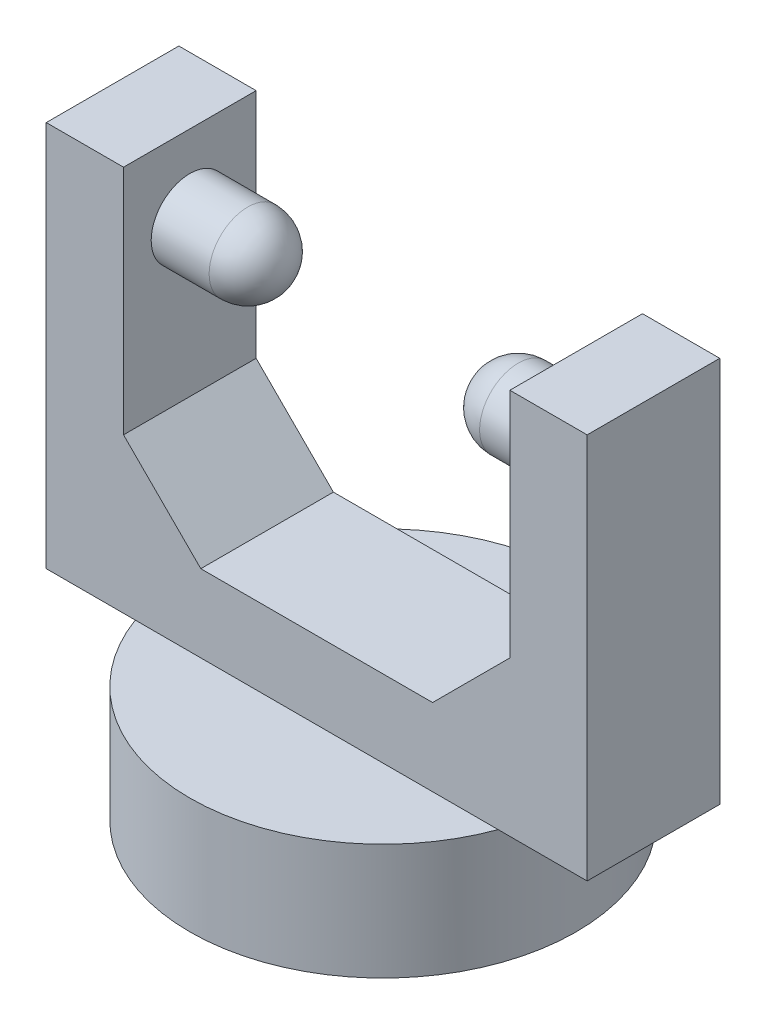
ISO-10303-21;
HEADER;
FILE_DESCRIPTION(('STEP AP214'),'2;1');
FILE_NAME('part.step','',(''),(''),'','','');
FILE_SCHEMA(('AUTOMOTIVE_DESIGN { 1 0 10303 214 1 1 1 1 }'));
ENDSEC;
DATA;
#1=APPLICATION_CONTEXT('core data for automotive mechanical design processes');
#2=APPLICATION_PROTOCOL_DEFINITION('international standard','automotive_design',2000,#1);
#3=PRODUCT_CONTEXT('',#1,'mechanical');
#4=PRODUCT('Part','Part','',(#3));
#5=PRODUCT_RELATED_PRODUCT_CATEGORY('part','',(#4));
#6=PRODUCT_DEFINITION_FORMATION('','',#4);
#7=PRODUCT_DEFINITION_CONTEXT('part definition',#1,'design');
#8=PRODUCT_DEFINITION('design','',#6,#7);
#9=PRODUCT_DEFINITION_SHAPE('','',#8);
#10=(LENGTH_UNIT() NAMED_UNIT(*) SI_UNIT(.MILLI.,.METRE.));
#11=(NAMED_UNIT(*) PLANE_ANGLE_UNIT() SI_UNIT($,.RADIAN.));
#12=(NAMED_UNIT(*) SI_UNIT($,.STERADIAN.) SOLID_ANGLE_UNIT());
#13=UNCERTAINTY_MEASURE_WITH_UNIT(LENGTH_MEASURE(1.E-05),#10,'distance_accuracy_value','');
#14=(GEOMETRIC_REPRESENTATION_CONTEXT(3) GLOBAL_UNCERTAINTY_ASSIGNED_CONTEXT((#13)) GLOBAL_UNIT_ASSIGNED_CONTEXT((#10,
#11,#12)) REPRESENTATION_CONTEXT('',''));
#15=CARTESIAN_POINT('',(0.,0.,0.));
#16=DIRECTION('',(0.,0.,1.));
#17=DIRECTION('',(1.,0.,0.));
#18=AXIS2_PLACEMENT_3D('',#15,#16,#17);
#19=CARTESIAN_POINT('',(0.,32.5,0.));
#20=DIRECTION('',(0.,1.,0.));
#21=DIRECTION('',(0.,0.,1.));
#22=AXIS2_PLACEMENT_3D('',#19,#20,#21);
#23=PLANE('',#22);
#24=DIRECTION('',(0.,0.,1.));
#25=VECTOR('',#24,1.);
#26=CARTESIAN_POINT('',(-12.5,32.5,-4.29038395748194));
#27=LINE('',#26,#25);
#28=CARTESIAN_POINT('',(-12.5,32.5,-4.29038395748194));
#29=VERTEX_POINT('',#28);
#30=CARTESIAN_POINT('',(-12.5,32.5,4.29038395748193));
#31=VERTEX_POINT('',#30);
#32=EDGE_CURVE('E143',#29,#31,#27,.T.);
#33=ORIENTED_EDGE('',*,*,#32,.F.);
#34=DIRECTION('',(-1.,0.,0.));
#35=VECTOR('',#34,1.);
#36=CARTESIAN_POINT('',(-17.5,32.5,-4.29038395748194));
#37=LINE('',#36,#35);
#38=CARTESIAN_POINT('',(-17.5,32.5,-4.29038395748194));
#39=VERTEX_POINT('',#38);
#40=EDGE_CURVE('E161',#29,#39,#37,.T.);
#41=ORIENTED_EDGE('',*,*,#40,.T.);
#42=DIRECTION('',(0.,0.,1.));
#43=VECTOR('',#42,1.);
#44=CARTESIAN_POINT('',(-17.5,32.5,-4.29038395748194));
#45=LINE('',#44,#43);
#46=CARTESIAN_POINT('',(-17.5,32.5,4.29038395748193));
#47=VERTEX_POINT('',#46);
#48=EDGE_CURVE('E153',#39,#47,#45,.T.);
#49=ORIENTED_EDGE('',*,*,#48,.T.);
#50=DIRECTION('',(1.,0.,0.));
#51=VECTOR('',#50,1.);
#52=CARTESIAN_POINT('',(-17.5,32.5,4.29038395748193));
#53=LINE('',#52,#51);
#54=EDGE_CURVE('E133',#47,#31,#53,.T.);
#55=ORIENTED_EDGE('',*,*,#54,.T.);
#56=EDGE_LOOP('',(#33,#41,#49,#55));
#57=FACE_BOUND('',#56,.T.);
#58=ADVANCED_FACE('F38',(#57),#23,.T.);
#59=CARTESIAN_POINT('',(0.,7.5,0.));
#60=DIRECTION('',(0.,1.,0.));
#61=DIRECTION('',(0.,0.,1.));
#62=AXIS2_PLACEMENT_3D('',#59,#60,#61);
#63=PLANE('',#62);
#64=DIRECTION('',(-1.,0.,0.));
#65=VECTOR('',#64,1.);
#66=CARTESIAN_POINT('',(-17.5,7.5,-4.29038395748194));
#67=LINE('',#66,#65);
#68=CARTESIAN_POINT('',(11.7406390583044,7.5,-4.29038395748194));
#69=VERTEX_POINT('',#68);
#70=CARTESIAN_POINT('',(-11.7406390583044,7.5,-4.29038395748194));
#71=VERTEX_POINT('',#70);
#72=EDGE_CURVE('E188',#69,#71,#67,.T.);
#73=ORIENTED_EDGE('',*,*,#72,.F.);
#74=CARTESIAN_POINT('',(0.,7.5,0.));
#75=DIRECTION('',(0.,1.,0.));
#76=DIRECTION('',(0.,0.,1.));
#77=AXIS2_PLACEMENT_3D('',#74,#75,#76);
#78=CIRCLE('',#77,12.5);
#79=EDGE_CURVE('E208',#69,#71,#78,.T.);
#80=ORIENTED_EDGE('',*,*,#79,.T.);
#81=EDGE_LOOP('',(#73,#80));
#82=FACE_BOUND('',#81,.T.);
#83=ADVANCED_FACE('F263',(#82),#63,.T.);
#84=CARTESIAN_POINT('',(0.,7.5,0.));
#85=DIRECTION('',(0.,-1.,0.));
#86=DIRECTION('',(0.,0.,-1.));
#87=AXIS2_PLACEMENT_3D('',#84,#85,#86);
#88=CYLINDRICAL_SURFACE('',#87,12.5);
#89=CARTESIAN_POINT('',(11.7406390583043,7.5,4.29038395748194));
#90=VERTEX_POINT('',#89);
#91=EDGE_CURVE('E204',#90,#69,#78,.T.);
#92=ORIENTED_EDGE('',*,*,#91,.F.);
#93=CARTESIAN_POINT('',(-11.7406390583044,7.5,4.29038395748193));
#94=VERTEX_POINT('',#93);
#95=EDGE_CURVE('E209',#94,#90,#78,.T.);
#96=ORIENTED_EDGE('',*,*,#95,.F.);
#97=EDGE_CURVE('E325',#71,#94,#78,.T.);
#98=ORIENTED_EDGE('',*,*,#97,.F.);
#99=ORIENTED_EDGE('',*,*,#79,.F.);
#100=EDGE_LOOP('',(#92,#96,#98,#99));
#101=FACE_BOUND('',#100,.T.);
#102=CARTESIAN_POINT('',(0.,0.,0.));
#103=DIRECTION('',(0.,1.,0.));
#104=DIRECTION('',(0.,0.,1.));
#105=AXIS2_PLACEMENT_3D('',#102,#103,#104);
#106=CIRCLE('',#105,12.5);
#107=CARTESIAN_POINT('',(0.,0.,12.5));
#108=VERTEX_POINT('',#107);
#109=EDGE_CURVE('E203',#108,#108,#106,.T.);
#110=ORIENTED_EDGE('',*,*,#109,.T.);
#111=EDGE_LOOP('',(#110));
#112=FACE_BOUND('',#111,.T.);
#113=ADVANCED_FACE('F269',(#101,#112),#88,.T.);
#114=DIRECTION('',(1.,0.,0.));
#115=VECTOR('',#114,1.);
#116=CARTESIAN_POINT('',(-17.5,7.5,4.29038395748193));
#117=LINE('',#116,#115);
#118=EDGE_CURVE('E180',#94,#90,#117,.T.);
#119=ORIENTED_EDGE('',*,*,#118,.F.);
#120=ORIENTED_EDGE('',*,*,#95,.T.);
#121=EDGE_LOOP('',(#119,#120));
#122=FACE_BOUND('',#121,.T.);
#123=ADVANCED_FACE('F272',(#122),#63,.T.);
#124=CARTESIAN_POINT('',(0.,0.,0.));
#125=DIRECTION('',(0.,1.,0.));
#126=DIRECTION('',(0.,0.,1.));
#127=AXIS2_PLACEMENT_3D('',#124,#125,#126);
#128=PLANE('',#127);
#129=ORIENTED_EDGE('',*,*,#109,.F.);
#130=EDGE_LOOP('',(#129));
#131=FACE_BOUND('',#130,.T.);
#132=ADVANCED_FACE('F348',(#131),#128,.F.);
#133=CARTESIAN_POINT('',(0.,7.5,0.));
#134=DIRECTION('',(0.,1.,0.));
#135=DIRECTION('',(0.,0.,1.));
#136=AXIS2_PLACEMENT_3D('',#133,#134,#135);
#137=PLANE('',#136);
#138=CARTESIAN_POINT('',(17.5,7.5,4.29038395748194));
#139=VERTEX_POINT('',#138);
#140=EDGE_CURVE('E174',#90,#139,#117,.T.);
#141=ORIENTED_EDGE('',*,*,#140,.F.);
#142=ORIENTED_EDGE('',*,*,#91,.T.);
#143=CARTESIAN_POINT('',(17.5,7.5,-4.29038395748194));
#144=VERTEX_POINT('',#143);
#145=EDGE_CURVE('E184',#144,#69,#67,.T.);
#146=ORIENTED_EDGE('',*,*,#145,.F.);
#147=DIRECTION('',(0.,0.,-1.));
#148=VECTOR('',#147,1.);
#149=CARTESIAN_POINT('',(17.5,7.5,-4.29038395748194));
#150=LINE('',#149,#148);
#151=EDGE_CURVE('E179',#139,#144,#150,.T.);
#152=ORIENTED_EDGE('',*,*,#151,.F.);
#153=EDGE_LOOP('',(#141,#142,#146,#152));
#154=FACE_BOUND('',#153,.T.);
#155=ADVANCED_FACE('F345',(#154),#137,.F.);
#156=CARTESIAN_POINT('',(-17.5,7.5,-4.29038395748194));
#157=VERTEX_POINT('',#156);
#158=EDGE_CURVE('E183',#71,#157,#67,.T.);
#159=ORIENTED_EDGE('',*,*,#158,.F.);
#160=ORIENTED_EDGE('',*,*,#97,.T.);
#161=CARTESIAN_POINT('',(-17.5,7.5,4.29038395748193));
#162=VERTEX_POINT('',#161);
#163=EDGE_CURVE('E175',#162,#94,#117,.T.);
#164=ORIENTED_EDGE('',*,*,#163,.F.);
#165=DIRECTION('',(0.,0.,1.));
#166=VECTOR('',#165,1.);
#167=CARTESIAN_POINT('',(-17.5,7.5,-4.29038395748194));
#168=LINE('',#167,#166);
#169=EDGE_CURVE('E170',#157,#162,#168,.T.);
#170=ORIENTED_EDGE('',*,*,#169,.F.);
#171=EDGE_LOOP('',(#159,#160,#164,#170));
#172=FACE_BOUND('',#171,.T.);
#173=ADVANCED_FACE('F338',(#172),#137,.F.);
#174=CARTESIAN_POINT('',(-17.5,32.5,-4.29038395748194));
#175=DIRECTION('',(1.,0.,0.));
#176=DIRECTION('',(0.,0.,-1.));
#177=AXIS2_PLACEMENT_3D('',#174,#175,#176);
#178=PLANE('',#177);
#179=ORIENTED_EDGE('',*,*,#169,.T.);
#180=DIRECTION('',(0.,-1.,0.));
#181=VECTOR('',#180,1.);
#182=CARTESIAN_POINT('',(-17.5,32.5,4.29038395748193));
#183=LINE('',#182,#181);
#184=EDGE_CURVE('E200',#47,#162,#183,.T.);
#185=ORIENTED_EDGE('',*,*,#184,.F.);
#186=ORIENTED_EDGE('',*,*,#48,.F.);
#187=DIRECTION('',(0.,-1.,0.));
#188=VECTOR('',#187,1.);
#189=CARTESIAN_POINT('',(-17.5,32.5,-4.29038395748194));
#190=LINE('',#189,#188);
#191=EDGE_CURVE('E169',#39,#157,#190,.T.);
#192=ORIENTED_EDGE('',*,*,#191,.T.);
#193=EDGE_LOOP('',(#179,#185,#186,#192));
#194=FACE_BOUND('',#193,.T.);
#195=ADVANCED_FACE('F337',(#194),#178,.F.);
#196=CARTESIAN_POINT('',(-17.5,32.5,4.29038395748193));
#197=DIRECTION('',(0.,0.,-1.));
#198=DIRECTION('',(-1.,0.,0.));
#199=AXIS2_PLACEMENT_3D('',#196,#197,#198);
#200=PLANE('',#199);
#201=DIRECTION('',(1.,0.,0.));
#202=VECTOR('',#201,1.);
#203=CARTESIAN_POINT('',(-12.5,12.5,4.29038395748193));
#204=LINE('',#203,#202);
#205=CARTESIAN_POINT('',(-7.49999999999997,12.5,4.29038395748193));
#206=VERTEX_POINT('',#205);
#207=CARTESIAN_POINT('',(7.49999999999997,12.5,4.29038395748193));
#208=VERTEX_POINT('',#207);
#209=EDGE_CURVE('E292',#206,#208,#204,.T.);
#210=ORIENTED_EDGE('',*,*,#209,.F.);
#211=DIRECTION('',(-0.707106781186551,0.707106781186544,0.));
#212=VECTOR('',#211,1.);
#213=CARTESIAN_POINT('',(-22.5,27.4999999999999,4.29038395748193));
#214=LINE('',#213,#212);
#215=CARTESIAN_POINT('',(-12.5,17.5,4.29038395748193));
#216=VERTEX_POINT('',#215);
#217=EDGE_CURVE('E135',#206,#216,#214,.T.);
#218=ORIENTED_EDGE('',*,*,#217,.T.);
#219=DIRECTION('',(0.,1.,0.));
#220=VECTOR('',#219,1.);
#221=CARTESIAN_POINT('',(-12.5,12.5,4.29038395748193));
#222=LINE('',#221,#220);
#223=EDGE_CURVE('E127',#216,#31,#222,.T.);
#224=ORIENTED_EDGE('',*,*,#223,.T.);
#225=ORIENTED_EDGE('',*,*,#54,.F.);
#226=ORIENTED_EDGE('',*,*,#184,.T.);
#227=ORIENTED_EDGE('',*,*,#163,.T.);
#228=ORIENTED_EDGE('',*,*,#118,.T.);
#229=ORIENTED_EDGE('',*,*,#140,.T.);
#230=DIRECTION('',(0.,-1.,0.));
#231=VECTOR('',#230,1.);
#232=CARTESIAN_POINT('',(17.5,32.5,4.29038395748194));
#233=LINE('',#232,#231);
#234=CARTESIAN_POINT('',(17.5,32.5,4.29038395748194));
#235=VERTEX_POINT('',#234);
#236=EDGE_CURVE('E196',#235,#139,#233,.T.);
#237=ORIENTED_EDGE('',*,*,#236,.F.);
#238=CARTESIAN_POINT('',(12.5,32.5,4.29038395748194));
#239=VERTEX_POINT('',#238);
#240=EDGE_CURVE('E157',#239,#235,#53,.T.);
#241=ORIENTED_EDGE('',*,*,#240,.F.);
#242=DIRECTION('',(0.,1.,0.));
#243=VECTOR('',#242,1.);
#244=CARTESIAN_POINT('',(12.5,12.5,4.29038395748193));
#245=LINE('',#244,#243);
#246=CARTESIAN_POINT('',(12.5,17.5,4.29038395748193));
#247=VERTEX_POINT('',#246);
#248=EDGE_CURVE('E139',#247,#239,#245,.T.);
#249=ORIENTED_EDGE('',*,*,#248,.F.);
#250=DIRECTION('',(-0.707106781186551,-0.707106781186544,0.));
#251=VECTOR('',#250,1.);
#252=CARTESIAN_POINT('',(4.99999999999987,9.99999999999991,4.29038395748193));
#253=LINE('',#252,#251);
#254=EDGE_CURVE('E242',#247,#208,#253,.T.);
#255=ORIENTED_EDGE('',*,*,#254,.T.);
#256=EDGE_LOOP('',(#210,#218,#224,#225,#226,#227,#228,#229,#237,#241,#249,#255));
#257=FACE_BOUND('',#256,.T.);
#258=ADVANCED_FACE('F130',(#257),#200,.F.);
#259=CARTESIAN_POINT('',(17.5,32.5,-4.29038395748194));
#260=DIRECTION('',(-1.,0.,0.));
#261=DIRECTION('',(0.,0.,1.));
#262=AXIS2_PLACEMENT_3D('',#259,#260,#261);
#263=PLANE('',#262);
#264=ORIENTED_EDGE('',*,*,#151,.T.);
#265=DIRECTION('',(0.,-1.,0.));
#266=VECTOR('',#265,1.);
#267=CARTESIAN_POINT('',(17.5,32.5,-4.29038395748194));
#268=LINE('',#267,#266);
#269=CARTESIAN_POINT('',(17.5,32.5,-4.29038395748194));
#270=VERTEX_POINT('',#269);
#271=EDGE_CURVE('E192',#270,#144,#268,.T.);
#272=ORIENTED_EDGE('',*,*,#271,.F.);
#273=DIRECTION('',(0.,0.,-1.));
#274=VECTOR('',#273,1.);
#275=CARTESIAN_POINT('',(17.5,32.5,-4.29038395748194));
#276=LINE('',#275,#274);
#277=EDGE_CURVE('E156',#235,#270,#276,.T.);
#278=ORIENTED_EDGE('',*,*,#277,.F.);
#279=ORIENTED_EDGE('',*,*,#236,.T.);
#280=EDGE_LOOP('',(#264,#272,#278,#279));
#281=FACE_BOUND('',#280,.T.);
#282=ADVANCED_FACE('F284',(#281),#263,.F.);
#283=CARTESIAN_POINT('',(-17.5,32.5,-4.29038395748194));
#284=DIRECTION('',(0.,0.,1.));
#285=DIRECTION('',(1.,0.,0.));
#286=AXIS2_PLACEMENT_3D('',#283,#284,#285);
#287=PLANE('',#286);
#288=ORIENTED_EDGE('',*,*,#40,.F.);
#289=DIRECTION('',(0.,1.,0.));
#290=VECTOR('',#289,1.);
#291=CARTESIAN_POINT('',(-12.5,12.5,-4.29038395748194));
#292=LINE('',#291,#290);
#293=CARTESIAN_POINT('',(-12.5,17.5,-4.29038395748194));
#294=VERTEX_POINT('',#293);
#295=EDGE_CURVE('E146',#294,#29,#292,.T.);
#296=ORIENTED_EDGE('',*,*,#295,.F.);
#297=DIRECTION('',(0.707106781186551,-0.707106781186544,0.));
#298=VECTOR('',#297,1.);
#299=CARTESIAN_POINT('',(-22.5,27.4999999999999,-4.29038395748194));
#300=LINE('',#299,#298);
#301=CARTESIAN_POINT('',(-7.49999999999997,12.5,-4.29038395748194));
#302=VERTEX_POINT('',#301);
#303=EDGE_CURVE('E230',#294,#302,#300,.T.);
#304=ORIENTED_EDGE('',*,*,#303,.T.);
#305=DIRECTION('',(-1.,0.,0.));
#306=VECTOR('',#305,1.);
#307=CARTESIAN_POINT('',(-12.5,12.5,-4.29038395748194));
#308=LINE('',#307,#306);
#309=CARTESIAN_POINT('',(7.49999999999996,12.5,-4.29038395748194));
#310=VERTEX_POINT('',#309);
#311=EDGE_CURVE('E140',#310,#302,#308,.T.);
#312=ORIENTED_EDGE('',*,*,#311,.F.);
#313=DIRECTION('',(0.707106781186551,0.707106781186544,0.));
#314=VECTOR('',#313,1.);
#315=CARTESIAN_POINT('',(4.99999999999987,9.99999999999991,-4.29038395748194));
#316=LINE('',#315,#314);
#317=CARTESIAN_POINT('',(12.5,17.5,-4.29038395748194));
#318=VERTEX_POINT('',#317);
#319=EDGE_CURVE('E62',#310,#318,#316,.T.);
#320=ORIENTED_EDGE('',*,*,#319,.T.);
#321=DIRECTION('',(0.,1.,0.));
#322=VECTOR('',#321,1.);
#323=CARTESIAN_POINT('',(12.5,12.5,-4.29038395748194));
#324=LINE('',#323,#322);
#325=CARTESIAN_POINT('',(12.5,32.5,-4.29038395748194));
#326=VERTEX_POINT('',#325);
#327=EDGE_CURVE('E302',#318,#326,#324,.T.);
#328=ORIENTED_EDGE('',*,*,#327,.T.);
#329=EDGE_CURVE('E165',#270,#326,#37,.T.);
#330=ORIENTED_EDGE('',*,*,#329,.F.);
#331=ORIENTED_EDGE('',*,*,#271,.T.);
#332=ORIENTED_EDGE('',*,*,#145,.T.);
#333=ORIENTED_EDGE('',*,*,#72,.T.);
#334=ORIENTED_EDGE('',*,*,#158,.T.);
#335=ORIENTED_EDGE('',*,*,#191,.F.);
#336=EDGE_LOOP('',(#288,#296,#304,#312,#320,#328,#330,#331,#332,#333,#334,#335));
#337=FACE_BOUND('',#336,.T.);
#338=ADVANCED_FACE('F276',(#337),#287,.F.);
#339=DIRECTION('',(0.,0.,-1.));
#340=VECTOR('',#339,1.);
#341=CARTESIAN_POINT('',(12.5,32.5,-4.29038395748194));
#342=LINE('',#341,#340);
#343=EDGE_CURVE('E150',#239,#326,#342,.T.);
#344=ORIENTED_EDGE('',*,*,#343,.F.);
#345=ORIENTED_EDGE('',*,*,#240,.T.);
#346=ORIENTED_EDGE('',*,*,#277,.T.);
#347=ORIENTED_EDGE('',*,*,#329,.T.);
#348=EDGE_LOOP('',(#344,#345,#346,#347));
#349=FACE_BOUND('',#348,.T.);
#350=ADVANCED_FACE('F265',(#349),#23,.T.);
#351=CARTESIAN_POINT('',(-12.5,12.5,-4.29038395748194));
#352=DIRECTION('',(-1.,0.,0.));
#353=DIRECTION('',(0.,0.,1.));
#354=AXIS2_PLACEMENT_3D('',#351,#352,#353);
#355=PLANE('',#354);
#356=CARTESIAN_POINT('',(-12.5,27.5,0.));
#357=DIRECTION('',(-1.,0.,0.));
#358=DIRECTION('',(0.,0.,1.));
#359=AXIS2_PLACEMENT_3D('',#356,#357,#358);
#360=CIRCLE('',#359,2.5);
#361=CARTESIAN_POINT('',(-12.5,27.5,2.5));
#362=VERTEX_POINT('',#361);
#363=EDGE_CURVE('E213',#362,#362,#360,.F.);
#364=ORIENTED_EDGE('',*,*,#363,.F.);
#365=EDGE_LOOP('',(#364));
#366=FACE_BOUND('',#365,.T.);
#367=ORIENTED_EDGE('',*,*,#223,.F.);
#368=DIRECTION('',(0.,0.,-1.));
#369=VECTOR('',#368,1.);
#370=CARTESIAN_POINT('',(-12.5,17.5,-4.29038395748194));
#371=LINE('',#370,#369);
#372=EDGE_CURVE('E225',#216,#294,#371,.T.);
#373=ORIENTED_EDGE('',*,*,#372,.T.);
#374=ORIENTED_EDGE('',*,*,#295,.T.);
#375=ORIENTED_EDGE('',*,*,#32,.T.);
#376=EDGE_LOOP('',(#367,#373,#374,#375));
#377=FACE_BOUND('',#376,.T.);
#378=ADVANCED_FACE('F144',(#366,#377),#355,.F.);
#379=CARTESIAN_POINT('',(12.5,12.5,-4.29038395748194));
#380=DIRECTION('',(1.,0.,0.));
#381=DIRECTION('',(0.,0.,-1.));
#382=AXIS2_PLACEMENT_3D('',#379,#380,#381);
#383=PLANE('',#382);
#384=CARTESIAN_POINT('',(12.5,27.5,0.));
#385=DIRECTION('',(1.,0.,0.));
#386=DIRECTION('',(0.,0.,-1.));
#387=AXIS2_PLACEMENT_3D('',#384,#385,#386);
#388=CIRCLE('',#387,2.5);
#389=CARTESIAN_POINT('',(12.5,27.5,-2.5));
#390=VERTEX_POINT('',#389);
#391=EDGE_CURVE('E217',#390,#390,#388,.F.);
#392=ORIENTED_EDGE('',*,*,#391,.F.);
#393=EDGE_LOOP('',(#392));
#394=FACE_BOUND('',#393,.T.);
#395=ORIENTED_EDGE('',*,*,#327,.F.);
#396=DIRECTION('',(0.,0.,1.));
#397=VECTOR('',#396,1.);
#398=CARTESIAN_POINT('',(12.5,17.5,-4.29038395748194));
#399=LINE('',#398,#397);
#400=EDGE_CURVE('E54',#318,#247,#399,.T.);
#401=ORIENTED_EDGE('',*,*,#400,.T.);
#402=ORIENTED_EDGE('',*,*,#248,.T.);
#403=ORIENTED_EDGE('',*,*,#343,.T.);
#404=EDGE_LOOP('',(#395,#401,#402,#403));
#405=FACE_BOUND('',#404,.T.);
#406=ADVANCED_FACE('F282',(#394,#405),#383,.F.);
#407=CARTESIAN_POINT('',(0.,12.5,0.));
#408=DIRECTION('',(0.,1.,0.));
#409=DIRECTION('',(0.,0.,1.));
#410=AXIS2_PLACEMENT_3D('',#407,#408,#409);
#411=PLANE('',#410);
#412=ORIENTED_EDGE('',*,*,#209,.T.);
#413=DIRECTION('',(0.,0.,-1.));
#414=VECTOR('',#413,1.);
#415=CARTESIAN_POINT('',(7.49999999999997,12.5,0.));
#416=LINE('',#415,#414);
#417=EDGE_CURVE('E234',#208,#310,#416,.T.);
#418=ORIENTED_EDGE('',*,*,#417,.T.);
#419=ORIENTED_EDGE('',*,*,#311,.T.);
#420=DIRECTION('',(0.,0.,1.));
#421=VECTOR('',#420,1.);
#422=CARTESIAN_POINT('',(-7.49999999999997,12.5,0.));
#423=LINE('',#422,#421);
#424=EDGE_CURVE('E221',#302,#206,#423,.T.);
#425=ORIENTED_EDGE('',*,*,#424,.T.);
#426=EDGE_LOOP('',(#412,#418,#419,#425));
#427=FACE_BOUND('',#426,.T.);
#428=ADVANCED_FACE('F316',(#427),#411,.T.);
#429=CARTESIAN_POINT('',(-6.25,27.5,0.));
#430=DIRECTION('',(-1.,0.,0.));
#431=DIRECTION('',(0.,0.,1.));
#432=AXIS2_PLACEMENT_3D('',#429,#430,#431);
#433=CYLINDRICAL_SURFACE('',#432,2.5);
#434=CARTESIAN_POINT('',(-8.75,27.5,0.));
#435=DIRECTION('',(-1.,0.,0.));
#436=DIRECTION('',(0.,0.,1.));
#437=AXIS2_PLACEMENT_3D('',#434,#435,#436);
#438=CIRCLE('',#437,2.5);
#439=CARTESIAN_POINT('',(-8.75,27.5,2.5));
#440=VERTEX_POINT('',#439);
#441=EDGE_CURVE('E47',#440,#440,#438,.T.);
#442=ORIENTED_EDGE('',*,*,#441,.T.);
#443=EDGE_LOOP('',(#442));
#444=FACE_BOUND('',#443,.T.);
#445=ORIENTED_EDGE('',*,*,#363,.T.);
#446=EDGE_LOOP('',(#445));
#447=FACE_BOUND('',#446,.T.);
#448=ADVANCED_FACE('F248',(#444,#447),#433,.T.);
#449=CARTESIAN_POINT('',(6.25,27.5,0.));
#450=DIRECTION('',(1.,0.,0.));
#451=DIRECTION('',(0.,0.,-1.));
#452=AXIS2_PLACEMENT_3D('',#449,#450,#451);
#453=CYLINDRICAL_SURFACE('',#452,2.5);
#454=CARTESIAN_POINT('',(8.75,27.5,0.));
#455=DIRECTION('',(1.,0.,0.));
#456=DIRECTION('',(0.,0.,-1.));
#457=AXIS2_PLACEMENT_3D('',#454,#455,#456);
#458=CIRCLE('',#457,2.5);
#459=CARTESIAN_POINT('',(8.75,27.5,-2.5));
#460=VERTEX_POINT('',#459);
#461=EDGE_CURVE('E11',#460,#460,#458,.T.);
#462=ORIENTED_EDGE('',*,*,#461,.T.);
#463=EDGE_LOOP('',(#462));
#464=FACE_BOUND('',#463,.T.);
#465=ORIENTED_EDGE('',*,*,#391,.T.);
#466=EDGE_LOOP('',(#465));
#467=FACE_BOUND('',#466,.T.);
#468=ADVANCED_FACE('F366',(#464,#467),#453,.T.);
#469=CARTESIAN_POINT('',(-7.49999999999997,12.5,0.));
#470=DIRECTION('',(-0.707106781186544,-0.707106781186551,0.));
#471=DIRECTION('',(0.,0.,1.));
#472=AXIS2_PLACEMENT_3D('',#469,#470,#471);
#473=PLANE('',#472);
#474=ORIENTED_EDGE('',*,*,#303,.F.);
#475=ORIENTED_EDGE('',*,*,#372,.F.);
#476=ORIENTED_EDGE('',*,*,#217,.F.);
#477=ORIENTED_EDGE('',*,*,#424,.F.);
#478=EDGE_LOOP('',(#474,#475,#476,#477));
#479=FACE_BOUND('',#478,.T.);
#480=ADVANCED_FACE('F259',(#479),#473,.F.);
#481=CARTESIAN_POINT('',(7.49999999999997,12.5,0.));
#482=DIRECTION('',(0.707106781186544,-0.707106781186551,0.));
#483=DIRECTION('',(0.,0.,-1.));
#484=AXIS2_PLACEMENT_3D('',#481,#482,#483);
#485=PLANE('',#484);
#486=ORIENTED_EDGE('',*,*,#254,.F.);
#487=ORIENTED_EDGE('',*,*,#400,.F.);
#488=ORIENTED_EDGE('',*,*,#319,.F.);
#489=ORIENTED_EDGE('',*,*,#417,.F.);
#490=EDGE_LOOP('',(#486,#487,#488,#489));
#491=FACE_BOUND('',#490,.T.);
#492=ADVANCED_FACE('F253',(#491),#485,.F.);
#493=CARTESIAN_POINT('',(-8.75,27.5,0.));
#494=DIRECTION('',(1.,0.,0.));
#495=DIRECTION('',(0.,0.,-1.));
#496=AXIS2_PLACEMENT_3D('',#493,#494,#495);
#497=SPHERICAL_SURFACE('',#496,2.5);
#498=ORIENTED_EDGE('',*,*,#441,.F.);
#499=EDGE_LOOP('',(#498));
#500=FACE_BOUND('',#499,.T.);
#501=ADVANCED_FACE('F251',(#500),#497,.T.);
#502=CARTESIAN_POINT('',(8.75,27.5,0.));
#503=DIRECTION('',(-1.,0.,0.));
#504=DIRECTION('',(0.,0.,1.));
#505=AXIS2_PLACEMENT_3D('',#502,#503,#504);
#506=SPHERICAL_SURFACE('',#505,2.5);
#507=ORIENTED_EDGE('',*,*,#461,.F.);
#508=EDGE_LOOP('',(#507));
#509=FACE_BOUND('',#508,.T.);
#510=ADVANCED_FACE('F40',(#509),#506,.T.);
#511=CLOSED_SHELL('',(#58,#83,#113,#123,#132,#155,#173,#195,#258,#282,#338,#350,#378,#406,#428,
#448,#468,#480,#492,#501,#510));
#512=MANIFOLD_SOLID_BREP('B2',#511);
#513=ADVANCED_BREP_SHAPE_REPRESENTATION('',(#18,#512),#14);
#514=SHAPE_DEFINITION_REPRESENTATION(#9,#513);
ENDSEC;
END-ISO-10303-21;
